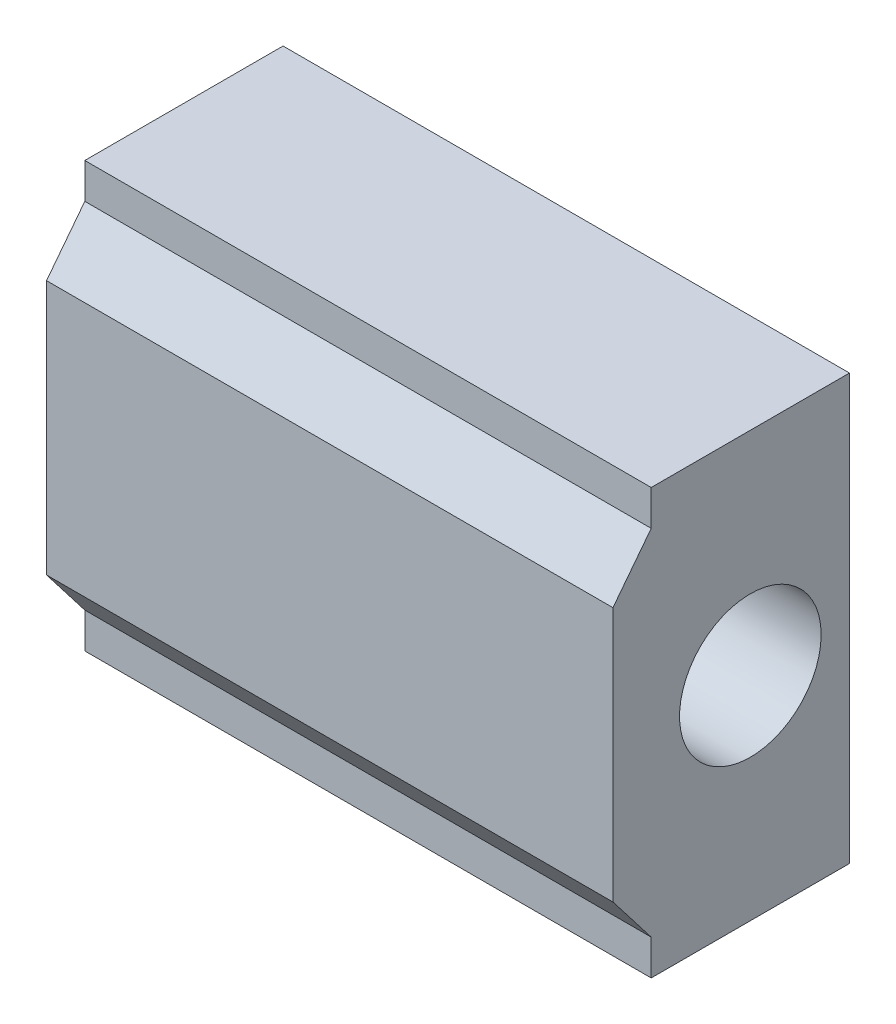
ISO-10303-21;
HEADER;
FILE_DESCRIPTION(('STEP AP214'),'2;1');
FILE_NAME('part.step','',(''),(''),'','','');
FILE_SCHEMA(('AUTOMOTIVE_DESIGN { 1 0 10303 214 1 1 1 1 }'));
ENDSEC;
DATA;
#1=APPLICATION_CONTEXT('core data for automotive mechanical design processes');
#2=APPLICATION_PROTOCOL_DEFINITION('international standard','automotive_design',2000,#1);
#3=PRODUCT_CONTEXT('',#1,'mechanical');
#4=PRODUCT('Part','Part','',(#3));
#5=PRODUCT_RELATED_PRODUCT_CATEGORY('part','',(#4));
#6=PRODUCT_DEFINITION_FORMATION('','',#4);
#7=PRODUCT_DEFINITION_CONTEXT('part definition',#1,'design');
#8=PRODUCT_DEFINITION('design','',#6,#7);
#9=PRODUCT_DEFINITION_SHAPE('','',#8);
#10=(LENGTH_UNIT() NAMED_UNIT(*) SI_UNIT(.MILLI.,.METRE.));
#11=(NAMED_UNIT(*) PLANE_ANGLE_UNIT() SI_UNIT($,.RADIAN.));
#12=(NAMED_UNIT(*) SI_UNIT($,.STERADIAN.) SOLID_ANGLE_UNIT());
#13=UNCERTAINTY_MEASURE_WITH_UNIT(LENGTH_MEASURE(1.E-05),#10,'distance_accuracy_value','');
#14=(GEOMETRIC_REPRESENTATION_CONTEXT(3) GLOBAL_UNCERTAINTY_ASSIGNED_CONTEXT((#13)) GLOBAL_UNIT_ASSIGNED_CONTEXT((#10,
#11,#12)) REPRESENTATION_CONTEXT('',''));
#15=CARTESIAN_POINT('',(0.,0.,0.));
#16=DIRECTION('',(0.,0.,1.));
#17=DIRECTION('',(1.,0.,0.));
#18=AXIS2_PLACEMENT_3D('',#15,#16,#17);
#19=CARTESIAN_POINT('',(40.,0.,0.));
#20=DIRECTION('',(-1.,0.,0.));
#21=DIRECTION('',(0.,0.,1.));
#22=AXIS2_PLACEMENT_3D('',#19,#20,#21);
#23=PLANE('',#22);
#24=DIRECTION('',(0.,-1.,0.));
#25=VECTOR('',#24,1.);
#26=CARTESIAN_POINT('',(40.,12.5,7.));
#27=LINE('',#26,#25);
#28=CARTESIAN_POINT('',(40.,15.,7.));
#29=VERTEX_POINT('',#28);
#30=CARTESIAN_POINT('',(40.,12.5,7.));
#31=VERTEX_POINT('',#30);
#32=EDGE_CURVE('E148',#29,#31,#27,.T.);
#33=ORIENTED_EDGE('',*,*,#32,.T.);
#34=DIRECTION('',(0.,-0.791506628950825,0.611160581457035));
#35=VECTOR('',#34,1.);
#36=CARTESIAN_POINT('',(40.,9.,9.70251941911723));
#37=LINE('',#36,#35);
#38=CARTESIAN_POINT('',(40.,9.,9.70251941911723));
#39=VERTEX_POINT('',#38);
#40=EDGE_CURVE('E96',#31,#39,#37,.T.);
#41=ORIENTED_EDGE('',*,*,#40,.T.);
#42=DIRECTION('',(0.,-1.,0.));
#43=VECTOR('',#42,1.);
#44=CARTESIAN_POINT('',(40.,-9.,9.70251941911723));
#45=LINE('',#44,#43);
#46=CARTESIAN_POINT('',(40.,-9.,9.70251941911723));
#47=VERTEX_POINT('',#46);
#48=EDGE_CURVE('E163',#39,#47,#45,.T.);
#49=ORIENTED_EDGE('',*,*,#48,.T.);
#50=DIRECTION('',(0.,-0.791506628950825,-0.611160581457035));
#51=VECTOR('',#50,1.);
#52=CARTESIAN_POINT('',(40.,-9.,9.70251941911723));
#53=LINE('',#52,#51);
#54=CARTESIAN_POINT('',(40.,-12.5,7.));
#55=VERTEX_POINT('',#54);
#56=EDGE_CURVE('E176',#47,#55,#53,.T.);
#57=ORIENTED_EDGE('',*,*,#56,.T.);
#58=DIRECTION('',(0.,-1.,0.));
#59=VECTOR('',#58,1.);
#60=CARTESIAN_POINT('',(40.,-12.5,7.));
#61=LINE('',#60,#59);
#62=CARTESIAN_POINT('',(40.,-15.,7.));
#63=VERTEX_POINT('',#62);
#64=EDGE_CURVE('E115',#55,#63,#61,.T.);
#65=ORIENTED_EDGE('',*,*,#64,.T.);
#66=DIRECTION('',(0.,0.,-1.));
#67=VECTOR('',#66,1.);
#68=CARTESIAN_POINT('',(40.,-15.,7.));
#69=LINE('',#68,#67);
#70=CARTESIAN_POINT('',(40.,-15.,-7.));
#71=VERTEX_POINT('',#70);
#72=EDGE_CURVE('E109',#63,#71,#69,.T.);
#73=ORIENTED_EDGE('',*,*,#72,.T.);
#74=DIRECTION('',(0.,1.,0.));
#75=VECTOR('',#74,1.);
#76=CARTESIAN_POINT('',(40.,15.,-7.));
#77=LINE('',#76,#75);
#78=CARTESIAN_POINT('',(40.,15.,-7.));
#79=VERTEX_POINT('',#78);
#80=EDGE_CURVE('E113',#71,#79,#77,.T.);
#81=ORIENTED_EDGE('',*,*,#80,.T.);
#82=DIRECTION('',(0.,0.,1.));
#83=VECTOR('',#82,1.);
#84=CARTESIAN_POINT('',(40.,15.,7.));
#85=LINE('',#84,#83);
#86=EDGE_CURVE('E53',#79,#29,#85,.T.);
#87=ORIENTED_EDGE('',*,*,#86,.T.);
#88=EDGE_LOOP('',(#33,#41,#49,#57,#65,#73,#81,#87));
#89=FACE_BOUND('',#88,.T.);
#90=CARTESIAN_POINT('',(40.,0.,0.));
#91=DIRECTION('',(1.,0.,0.));
#92=DIRECTION('',(0.,0.,-1.));
#93=AXIS2_PLACEMENT_3D('',#90,#91,#92);
#94=CIRCLE('',#93,5.);
#95=CARTESIAN_POINT('',(40.,0.,-5.));
#96=VERTEX_POINT('',#95);
#97=EDGE_CURVE('E137',#96,#96,#94,.T.);
#98=ORIENTED_EDGE('',*,*,#97,.F.);
#99=EDGE_LOOP('',(#98));
#100=FACE_BOUND('',#99,.T.);
#101=ADVANCED_FACE('F36',(#89,#100),#23,.F.);
#102=CARTESIAN_POINT('',(0.,0.,0.));
#103=DIRECTION('',(-1.,0.,0.));
#104=DIRECTION('',(0.,0.,1.));
#105=AXIS2_PLACEMENT_3D('',#102,#103,#104);
#106=PLANE('',#105);
#107=DIRECTION('',(0.,-1.,0.));
#108=VECTOR('',#107,1.);
#109=CARTESIAN_POINT('',(0.,12.5,7.));
#110=LINE('',#109,#108);
#111=CARTESIAN_POINT('',(0.,15.,7.));
#112=VERTEX_POINT('',#111);
#113=CARTESIAN_POINT('',(0.,12.5,7.));
#114=VERTEX_POINT('',#113);
#115=EDGE_CURVE('E133',#112,#114,#110,.T.);
#116=ORIENTED_EDGE('',*,*,#115,.F.);
#117=DIRECTION('',(0.,0.,1.));
#118=VECTOR('',#117,1.);
#119=CARTESIAN_POINT('',(0.,15.,7.));
#120=LINE('',#119,#118);
#121=CARTESIAN_POINT('',(0.,15.,-7.));
#122=VERTEX_POINT('',#121);
#123=EDGE_CURVE('E88',#122,#112,#120,.T.);
#124=ORIENTED_EDGE('',*,*,#123,.F.);
#125=DIRECTION('',(0.,1.,0.));
#126=VECTOR('',#125,1.);
#127=CARTESIAN_POINT('',(0.,15.,-7.));
#128=LINE('',#127,#126);
#129=CARTESIAN_POINT('',(0.,-15.,-7.));
#130=VERTEX_POINT('',#129);
#131=EDGE_CURVE('E82',#130,#122,#128,.T.);
#132=ORIENTED_EDGE('',*,*,#131,.F.);
#133=DIRECTION('',(0.,0.,-1.));
#134=VECTOR('',#133,1.);
#135=CARTESIAN_POINT('',(0.,-15.,7.));
#136=LINE('',#135,#134);
#137=CARTESIAN_POINT('',(0.,-15.,7.));
#138=VERTEX_POINT('',#137);
#139=EDGE_CURVE('E123',#138,#130,#136,.T.);
#140=ORIENTED_EDGE('',*,*,#139,.F.);
#141=DIRECTION('',(0.,-1.,0.));
#142=VECTOR('',#141,1.);
#143=CARTESIAN_POINT('',(0.,-12.5,7.));
#144=LINE('',#143,#142);
#145=CARTESIAN_POINT('',(0.,-12.5,7.));
#146=VERTEX_POINT('',#145);
#147=EDGE_CURVE('E143',#146,#138,#144,.T.);
#148=ORIENTED_EDGE('',*,*,#147,.F.);
#149=DIRECTION('',(0.,-0.791506628950825,-0.611160581457035));
#150=VECTOR('',#149,1.);
#151=CARTESIAN_POINT('',(0.,-9.,9.70251941911723));
#152=LINE('',#151,#150);
#153=CARTESIAN_POINT('',(0.,-9.,9.70251941911723));
#154=VERTEX_POINT('',#153);
#155=EDGE_CURVE('E141',#154,#146,#152,.T.);
#156=ORIENTED_EDGE('',*,*,#155,.F.);
#157=DIRECTION('',(0.,-1.,0.));
#158=VECTOR('',#157,1.);
#159=CARTESIAN_POINT('',(0.,-9.,9.70251941911723));
#160=LINE('',#159,#158);
#161=CARTESIAN_POINT('',(0.,9.,9.70251941911723));
#162=VERTEX_POINT('',#161);
#163=EDGE_CURVE('E139',#162,#154,#160,.T.);
#164=ORIENTED_EDGE('',*,*,#163,.F.);
#165=DIRECTION('',(0.,-0.791506628950825,0.611160581457035));
#166=VECTOR('',#165,1.);
#167=CARTESIAN_POINT('',(0.,9.,9.70251941911723));
#168=LINE('',#167,#166);
#169=EDGE_CURVE('E136',#114,#162,#168,.T.);
#170=ORIENTED_EDGE('',*,*,#169,.F.);
#171=EDGE_LOOP('',(#116,#124,#132,#140,#148,#156,#164,#170));
#172=FACE_BOUND('',#171,.T.);
#173=CARTESIAN_POINT('',(0.,0.,0.));
#174=DIRECTION('',(1.,0.,0.));
#175=DIRECTION('',(0.,0.,-1.));
#176=AXIS2_PLACEMENT_3D('',#173,#174,#175);
#177=CIRCLE('',#176,5.);
#178=CARTESIAN_POINT('',(0.,0.,-5.));
#179=VERTEX_POINT('',#178);
#180=EDGE_CURVE('E182',#179,#179,#177,.T.);
#181=ORIENTED_EDGE('',*,*,#180,.T.);
#182=EDGE_LOOP('',(#181));
#183=FACE_BOUND('',#182,.T.);
#184=ADVANCED_FACE('F167',(#172,#183),#106,.T.);
#185=CARTESIAN_POINT('',(40.,12.5,7.));
#186=DIRECTION('',(0.,0.,-1.));
#187=DIRECTION('',(-1.,0.,0.));
#188=AXIS2_PLACEMENT_3D('',#185,#186,#187);
#189=PLANE('',#188);
#190=ORIENTED_EDGE('',*,*,#115,.T.);
#191=DIRECTION('',(-1.,0.,0.));
#192=VECTOR('',#191,1.);
#193=CARTESIAN_POINT('',(40.,12.5,7.));
#194=LINE('',#193,#192);
#195=EDGE_CURVE('E11',#31,#114,#194,.T.);
#196=ORIENTED_EDGE('',*,*,#195,.F.);
#197=ORIENTED_EDGE('',*,*,#32,.F.);
#198=DIRECTION('',(-1.,0.,0.));
#199=VECTOR('',#198,1.);
#200=CARTESIAN_POINT('',(40.,15.,7.));
#201=LINE('',#200,#199);
#202=EDGE_CURVE('E129',#29,#112,#201,.T.);
#203=ORIENTED_EDGE('',*,*,#202,.T.);
#204=EDGE_LOOP('',(#190,#196,#197,#203));
#205=FACE_BOUND('',#204,.T.);
#206=ADVANCED_FACE('F38',(#205),#189,.F.);
#207=CARTESIAN_POINT('',(40.,9.,9.70251941911723));
#208=DIRECTION('',(0.,-0.611160581457035,-0.791506628950825));
#209=DIRECTION('',(0.,0.791506628950825,-0.611160581457035));
#210=AXIS2_PLACEMENT_3D('',#207,#208,#209);
#211=PLANE('',#210);
#212=ORIENTED_EDGE('',*,*,#169,.T.);
#213=DIRECTION('',(-1.,0.,0.));
#214=VECTOR('',#213,1.);
#215=CARTESIAN_POINT('',(40.,9.,9.70251941911723));
#216=LINE('',#215,#214);
#217=EDGE_CURVE('E45',#39,#162,#216,.T.);
#218=ORIENTED_EDGE('',*,*,#217,.F.);
#219=ORIENTED_EDGE('',*,*,#40,.F.);
#220=ORIENTED_EDGE('',*,*,#195,.T.);
#221=EDGE_LOOP('',(#212,#218,#219,#220));
#222=FACE_BOUND('',#221,.T.);
#223=ADVANCED_FACE('F210',(#222),#211,.F.);
#224=CARTESIAN_POINT('',(40.,-9.,9.70251941911723));
#225=DIRECTION('',(0.,0.,-1.));
#226=DIRECTION('',(-1.,0.,0.));
#227=AXIS2_PLACEMENT_3D('',#224,#225,#226);
#228=PLANE('',#227);
#229=ORIENTED_EDGE('',*,*,#163,.T.);
#230=DIRECTION('',(-1.,0.,0.));
#231=VECTOR('',#230,1.);
#232=CARTESIAN_POINT('',(40.,-9.,9.70251941911723));
#233=LINE('',#232,#231);
#234=EDGE_CURVE('E155',#47,#154,#233,.T.);
#235=ORIENTED_EDGE('',*,*,#234,.F.);
#236=ORIENTED_EDGE('',*,*,#48,.F.);
#237=ORIENTED_EDGE('',*,*,#217,.T.);
#238=EDGE_LOOP('',(#229,#235,#236,#237));
#239=FACE_BOUND('',#238,.T.);
#240=ADVANCED_FACE('F161',(#239),#228,.F.);
#241=CARTESIAN_POINT('',(40.,-9.,9.70251941911723));
#242=DIRECTION('',(0.,0.611160581457035,-0.791506628950825));
#243=DIRECTION('',(0.,0.791506628950825,0.611160581457035));
#244=AXIS2_PLACEMENT_3D('',#241,#242,#243);
#245=PLANE('',#244);
#246=ORIENTED_EDGE('',*,*,#155,.T.);
#247=DIRECTION('',(-1.,0.,0.));
#248=VECTOR('',#247,1.);
#249=CARTESIAN_POINT('',(40.,-12.5,7.));
#250=LINE('',#249,#248);
#251=EDGE_CURVE('E152',#55,#146,#250,.T.);
#252=ORIENTED_EDGE('',*,*,#251,.F.);
#253=ORIENTED_EDGE('',*,*,#56,.F.);
#254=ORIENTED_EDGE('',*,*,#234,.T.);
#255=EDGE_LOOP('',(#246,#252,#253,#254));
#256=FACE_BOUND('',#255,.T.);
#257=ADVANCED_FACE('F172',(#256),#245,.F.);
#258=CARTESIAN_POINT('',(40.,-12.5,7.));
#259=DIRECTION('',(0.,0.,-1.));
#260=DIRECTION('',(-1.,0.,0.));
#261=AXIS2_PLACEMENT_3D('',#258,#259,#260);
#262=PLANE('',#261);
#263=ORIENTED_EDGE('',*,*,#147,.T.);
#264=DIRECTION('',(-1.,0.,0.));
#265=VECTOR('',#264,1.);
#266=CARTESIAN_POINT('',(40.,-15.,7.));
#267=LINE('',#266,#265);
#268=EDGE_CURVE('E124',#63,#138,#267,.T.);
#269=ORIENTED_EDGE('',*,*,#268,.F.);
#270=ORIENTED_EDGE('',*,*,#64,.F.);
#271=ORIENTED_EDGE('',*,*,#251,.T.);
#272=EDGE_LOOP('',(#263,#269,#270,#271));
#273=FACE_BOUND('',#272,.T.);
#274=ADVANCED_FACE('F175',(#273),#262,.F.);
#275=CARTESIAN_POINT('',(40.,-15.,7.));
#276=DIRECTION('',(0.,1.,0.));
#277=DIRECTION('',(0.,0.,1.));
#278=AXIS2_PLACEMENT_3D('',#275,#276,#277);
#279=PLANE('',#278);
#280=ORIENTED_EDGE('',*,*,#139,.T.);
#281=DIRECTION('',(-1.,0.,0.));
#282=VECTOR('',#281,1.);
#283=CARTESIAN_POINT('',(40.,-15.,-7.));
#284=LINE('',#283,#282);
#285=EDGE_CURVE('E120',#71,#130,#284,.T.);
#286=ORIENTED_EDGE('',*,*,#285,.F.);
#287=ORIENTED_EDGE('',*,*,#72,.F.);
#288=ORIENTED_EDGE('',*,*,#268,.T.);
#289=EDGE_LOOP('',(#280,#286,#287,#288));
#290=FACE_BOUND('',#289,.T.);
#291=ADVANCED_FACE('F121',(#290),#279,.F.);
#292=CARTESIAN_POINT('',(40.,15.,-7.));
#293=DIRECTION('',(0.,0.,1.));
#294=DIRECTION('',(1.,0.,0.));
#295=AXIS2_PLACEMENT_3D('',#292,#293,#294);
#296=PLANE('',#295);
#297=ORIENTED_EDGE('',*,*,#131,.T.);
#298=DIRECTION('',(-1.,0.,0.));
#299=VECTOR('',#298,1.);
#300=CARTESIAN_POINT('',(40.,15.,-7.));
#301=LINE('',#300,#299);
#302=EDGE_CURVE('E125',#79,#122,#301,.T.);
#303=ORIENTED_EDGE('',*,*,#302,.F.);
#304=ORIENTED_EDGE('',*,*,#80,.F.);
#305=ORIENTED_EDGE('',*,*,#285,.T.);
#306=EDGE_LOOP('',(#297,#303,#304,#305));
#307=FACE_BOUND('',#306,.T.);
#308=ADVANCED_FACE('F127',(#307),#296,.F.);
#309=CARTESIAN_POINT('',(40.,15.,7.));
#310=DIRECTION('',(0.,-1.,0.));
#311=DIRECTION('',(0.,0.,-1.));
#312=AXIS2_PLACEMENT_3D('',#309,#310,#311);
#313=PLANE('',#312);
#314=ORIENTED_EDGE('',*,*,#123,.T.);
#315=ORIENTED_EDGE('',*,*,#202,.F.);
#316=ORIENTED_EDGE('',*,*,#86,.F.);
#317=ORIENTED_EDGE('',*,*,#302,.T.);
#318=EDGE_LOOP('',(#314,#315,#316,#317));
#319=FACE_BOUND('',#318,.T.);
#320=ADVANCED_FACE('F198',(#319),#313,.F.);
#321=CARTESIAN_POINT('',(40.,0.,0.));
#322=DIRECTION('',(-1.,0.,0.));
#323=DIRECTION('',(0.,0.,1.));
#324=AXIS2_PLACEMENT_3D('',#321,#322,#323);
#325=CYLINDRICAL_SURFACE('',#324,5.);
#326=ORIENTED_EDGE('',*,*,#97,.T.);
#327=EDGE_LOOP('',(#326));
#328=FACE_BOUND('',#327,.T.);
#329=ORIENTED_EDGE('',*,*,#180,.F.);
#330=EDGE_LOOP('',(#329));
#331=FACE_BOUND('',#330,.T.);
#332=ADVANCED_FACE('F188',(#328,#331),#325,.F.);
#333=CLOSED_SHELL('',(#101,#184,#206,#223,#240,#257,#274,#291,#308,#320,#332));
#334=MANIFOLD_SOLID_BREP('B2',#333);
#335=ADVANCED_BREP_SHAPE_REPRESENTATION('',(#18,#334),#14);
#336=SHAPE_DEFINITION_REPRESENTATION(#9,#335);
ENDSEC;
END-ISO-10303-21;
